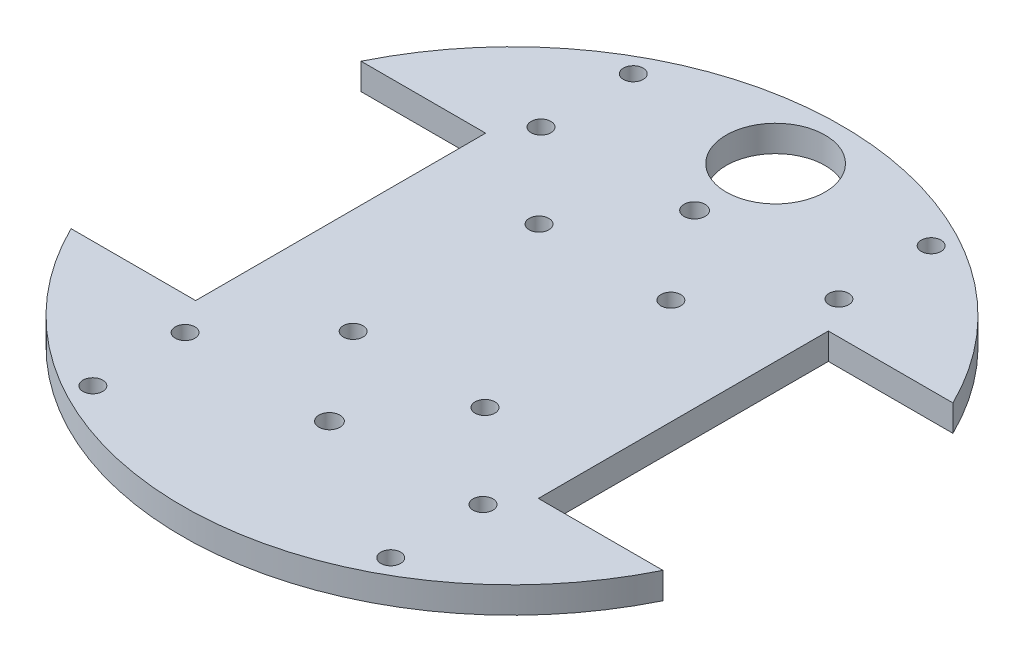
ISO-10303-21;
HEADER;
FILE_DESCRIPTION(('STEP AP214'),'2;1');
FILE_NAME('part.step','',(''),(''),'','','');
FILE_SCHEMA(('AUTOMOTIVE_DESIGN { 1 0 10303 214 1 1 1 1 }'));
ENDSEC;
DATA;
#1=APPLICATION_CONTEXT('core data for automotive mechanical design processes');
#2=APPLICATION_PROTOCOL_DEFINITION('international standard','automotive_design',2000,#1);
#3=PRODUCT_CONTEXT('',#1,'mechanical');
#4=PRODUCT('Part','Part','',(#3));
#5=PRODUCT_RELATED_PRODUCT_CATEGORY('part','',(#4));
#6=PRODUCT_DEFINITION_FORMATION('','',#4);
#7=PRODUCT_DEFINITION_CONTEXT('part definition',#1,'design');
#8=PRODUCT_DEFINITION('design','',#6,#7);
#9=PRODUCT_DEFINITION_SHAPE('','',#8);
#10=(LENGTH_UNIT() NAMED_UNIT(*) SI_UNIT(.MILLI.,.METRE.));
#11=(NAMED_UNIT(*) PLANE_ANGLE_UNIT() SI_UNIT($,.RADIAN.));
#12=(NAMED_UNIT(*) SI_UNIT($,.STERADIAN.) SOLID_ANGLE_UNIT());
#13=UNCERTAINTY_MEASURE_WITH_UNIT(LENGTH_MEASURE(1.E-05),#10,'distance_accuracy_value','');
#14=(GEOMETRIC_REPRESENTATION_CONTEXT(3) GLOBAL_UNCERTAINTY_ASSIGNED_CONTEXT((#13)) GLOBAL_UNIT_ASSIGNED_CONTEXT((#10,
#11,#12)) REPRESENTATION_CONTEXT('',''));
#15=CARTESIAN_POINT('',(0.,0.,0.));
#16=DIRECTION('',(0.,0.,1.));
#17=DIRECTION('',(1.,0.,0.));
#18=AXIS2_PLACEMENT_3D('',#15,#16,#17);
#19=CARTESIAN_POINT('',(0.,4.,-22.));
#20=DIRECTION('',(0.,0.,1.));
#21=DIRECTION('',(1.,0.,0.));
#22=AXIS2_PLACEMENT_3D('',#19,#20,#21);
#23=PLANE('',#22);
#24=DIRECTION('',(-1.,0.,0.));
#25=VECTOR('',#24,1.);
#26=CARTESIAN_POINT('',(0.,0.,-22.));
#27=LINE('',#26,#25);
#28=CARTESIAN_POINT('',(-26.,0.,-22.));
#29=VERTEX_POINT('',#28);
#30=CARTESIAN_POINT('',(-44.8998886412873,0.,-22.));
#31=VERTEX_POINT('',#30);
#32=EDGE_CURVE('E202',#29,#31,#27,.T.);
#33=ORIENTED_EDGE('',*,*,#32,.F.);
#34=DIRECTION('',(0.,-1.,0.));
#35=VECTOR('',#34,1.);
#36=CARTESIAN_POINT('',(-26.,4.,-22.));
#37=LINE('',#36,#35);
#38=CARTESIAN_POINT('',(-26.,4.,-22.));
#39=VERTEX_POINT('',#38);
#40=EDGE_CURVE('E11',#39,#29,#37,.T.);
#41=ORIENTED_EDGE('',*,*,#40,.F.);
#42=DIRECTION('',(-1.,0.,0.));
#43=VECTOR('',#42,1.);
#44=CARTESIAN_POINT('',(0.,4.,-22.));
#45=LINE('',#44,#43);
#46=CARTESIAN_POINT('',(-44.8998886412873,4.,-22.));
#47=VERTEX_POINT('',#46);
#48=EDGE_CURVE('E287',#39,#47,#45,.T.);
#49=ORIENTED_EDGE('',*,*,#48,.T.);
#50=DIRECTION('',(0.,-1.,0.));
#51=VECTOR('',#50,1.);
#52=CARTESIAN_POINT('',(-44.8998886412873,4.,-22.));
#53=LINE('',#52,#51);
#54=EDGE_CURVE('E92',#47,#31,#53,.T.);
#55=ORIENTED_EDGE('',*,*,#54,.T.);
#56=EDGE_LOOP('',(#33,#41,#49,#55));
#57=FACE_BOUND('',#56,.T.);
#58=ADVANCED_FACE('F41',(#57),#23,.T.);
#59=CARTESIAN_POINT('',(-26.,4.,0.));
#60=DIRECTION('',(1.,0.,0.));
#61=DIRECTION('',(0.,0.,-1.));
#62=AXIS2_PLACEMENT_3D('',#59,#60,#61);
#63=PLANE('',#62);
#64=DIRECTION('',(0.,0.,1.));
#65=VECTOR('',#64,1.);
#66=CARTESIAN_POINT('',(-26.,0.,0.));
#67=LINE('',#66,#65);
#68=CARTESIAN_POINT('',(-26.,0.,22.));
#69=VERTEX_POINT('',#68);
#70=EDGE_CURVE('E206',#29,#69,#67,.T.);
#71=ORIENTED_EDGE('',*,*,#70,.T.);
#72=DIRECTION('',(0.,-1.,0.));
#73=VECTOR('',#72,1.);
#74=CARTESIAN_POINT('',(-26.,4.,22.));
#75=LINE('',#74,#73);
#76=CARTESIAN_POINT('',(-26.,4.,22.));
#77=VERTEX_POINT('',#76);
#78=EDGE_CURVE('E50',#77,#69,#75,.T.);
#79=ORIENTED_EDGE('',*,*,#78,.F.);
#80=DIRECTION('',(0.,0.,1.));
#81=VECTOR('',#80,1.);
#82=CARTESIAN_POINT('',(-26.,4.,0.));
#83=LINE('',#82,#81);
#84=EDGE_CURVE('E322',#39,#77,#83,.T.);
#85=ORIENTED_EDGE('',*,*,#84,.F.);
#86=ORIENTED_EDGE('',*,*,#40,.T.);
#87=EDGE_LOOP('',(#71,#79,#85,#86));
#88=FACE_BOUND('',#87,.T.);
#89=ADVANCED_FACE('F328',(#88),#63,.F.);
#90=CARTESIAN_POINT('',(0.,4.,22.));
#91=DIRECTION('',(0.,0.,1.));
#92=DIRECTION('',(1.,0.,0.));
#93=AXIS2_PLACEMENT_3D('',#90,#91,#92);
#94=PLANE('',#93);
#95=DIRECTION('',(-1.,0.,0.));
#96=VECTOR('',#95,1.);
#97=CARTESIAN_POINT('',(0.,0.,22.));
#98=LINE('',#97,#96);
#99=CARTESIAN_POINT('',(-44.8998886412873,0.,22.));
#100=VERTEX_POINT('',#99);
#101=EDGE_CURVE('E209',#69,#100,#98,.T.);
#102=ORIENTED_EDGE('',*,*,#101,.T.);
#103=DIRECTION('',(0.,-1.,0.));
#104=VECTOR('',#103,1.);
#105=CARTESIAN_POINT('',(-44.8998886412873,4.,22.));
#106=LINE('',#105,#104);
#107=CARTESIAN_POINT('',(-44.8998886412873,4.,22.));
#108=VERTEX_POINT('',#107);
#109=EDGE_CURVE('E297',#108,#100,#106,.T.);
#110=ORIENTED_EDGE('',*,*,#109,.F.);
#111=DIRECTION('',(-1.,0.,0.));
#112=VECTOR('',#111,1.);
#113=CARTESIAN_POINT('',(0.,4.,22.));
#114=LINE('',#113,#112);
#115=EDGE_CURVE('E308',#77,#108,#114,.T.);
#116=ORIENTED_EDGE('',*,*,#115,.F.);
#117=ORIENTED_EDGE('',*,*,#78,.T.);
#118=EDGE_LOOP('',(#102,#110,#116,#117));
#119=FACE_BOUND('',#118,.T.);
#120=ADVANCED_FACE('F306',(#119),#94,.F.);
#121=CARTESIAN_POINT('',(0.,4.,0.));
#122=DIRECTION('',(0.,-1.,0.));
#123=DIRECTION('',(0.,0.,-1.));
#124=AXIS2_PLACEMENT_3D('',#121,#122,#123);
#125=CYLINDRICAL_SURFACE('',#124,50.);
#126=CARTESIAN_POINT('',(0.,0.,0.));
#127=DIRECTION('',(0.,1.,0.));
#128=DIRECTION('',(0.,0.,1.));
#129=AXIS2_PLACEMENT_3D('',#126,#127,#128);
#130=CIRCLE('',#129,50.);
#131=CARTESIAN_POINT('',(44.8998886412873,0.,22.));
#132=VERTEX_POINT('',#131);
#133=EDGE_CURVE('E212',#100,#132,#130,.T.);
#134=ORIENTED_EDGE('',*,*,#133,.T.);
#135=DIRECTION('',(0.,-1.,0.));
#136=VECTOR('',#135,1.);
#137=CARTESIAN_POINT('',(44.8998886412873,4.,22.));
#138=LINE('',#137,#136);
#139=CARTESIAN_POINT('',(44.8998886412873,4.,22.));
#140=VERTEX_POINT('',#139);
#141=EDGE_CURVE('E294',#140,#132,#138,.T.);
#142=ORIENTED_EDGE('',*,*,#141,.F.);
#143=CARTESIAN_POINT('',(0.,4.,0.));
#144=DIRECTION('',(0.,1.,0.));
#145=DIRECTION('',(0.,0.,1.));
#146=AXIS2_PLACEMENT_3D('',#143,#144,#145);
#147=CIRCLE('',#146,50.);
#148=EDGE_CURVE('E136',#108,#140,#147,.T.);
#149=ORIENTED_EDGE('',*,*,#148,.F.);
#150=ORIENTED_EDGE('',*,*,#109,.T.);
#151=EDGE_LOOP('',(#134,#142,#149,#150));
#152=FACE_BOUND('',#151,.T.);
#153=ADVANCED_FACE('F318',(#152),#125,.T.);
#154=CARTESIAN_POINT('',(0.,4.,22.));
#155=DIRECTION('',(0.,0.,-1.));
#156=DIRECTION('',(-1.,0.,0.));
#157=AXIS2_PLACEMENT_3D('',#154,#155,#156);
#158=PLANE('',#157);
#159=DIRECTION('',(1.,0.,0.));
#160=VECTOR('',#159,1.);
#161=CARTESIAN_POINT('',(0.,0.,22.));
#162=LINE('',#161,#160);
#163=CARTESIAN_POINT('',(26.,0.,22.));
#164=VERTEX_POINT('',#163);
#165=EDGE_CURVE('E216',#164,#132,#162,.T.);
#166=ORIENTED_EDGE('',*,*,#165,.F.);
#167=DIRECTION('',(0.,-1.,0.));
#168=VECTOR('',#167,1.);
#169=CARTESIAN_POINT('',(26.,4.,22.));
#170=LINE('',#169,#168);
#171=CARTESIAN_POINT('',(26.,4.,22.));
#172=VERTEX_POINT('',#171);
#173=EDGE_CURVE('E121',#172,#164,#170,.T.);
#174=ORIENTED_EDGE('',*,*,#173,.F.);
#175=DIRECTION('',(1.,0.,0.));
#176=VECTOR('',#175,1.);
#177=CARTESIAN_POINT('',(0.,4.,22.));
#178=LINE('',#177,#176);
#179=EDGE_CURVE('E132',#172,#140,#178,.T.);
#180=ORIENTED_EDGE('',*,*,#179,.T.);
#181=ORIENTED_EDGE('',*,*,#141,.T.);
#182=EDGE_LOOP('',(#166,#174,#180,#181));
#183=FACE_BOUND('',#182,.T.);
#184=ADVANCED_FACE('F338',(#183),#158,.T.);
#185=CARTESIAN_POINT('',(26.,4.,0.));
#186=DIRECTION('',(1.,0.,0.));
#187=DIRECTION('',(0.,0.,-1.));
#188=AXIS2_PLACEMENT_3D('',#185,#186,#187);
#189=PLANE('',#188);
#190=DIRECTION('',(0.,0.,1.));
#191=VECTOR('',#190,1.);
#192=CARTESIAN_POINT('',(26.,0.,0.));
#193=LINE('',#192,#191);
#194=CARTESIAN_POINT('',(26.,0.,-22.));
#195=VERTEX_POINT('',#194);
#196=EDGE_CURVE('E119',#195,#164,#193,.T.);
#197=ORIENTED_EDGE('',*,*,#196,.F.);
#198=DIRECTION('',(0.,-1.,0.));
#199=VECTOR('',#198,1.);
#200=CARTESIAN_POINT('',(26.,4.,-22.));
#201=LINE('',#200,#199);
#202=CARTESIAN_POINT('',(26.,4.,-22.));
#203=VERTEX_POINT('',#202);
#204=EDGE_CURVE('E113',#203,#195,#201,.T.);
#205=ORIENTED_EDGE('',*,*,#204,.F.);
#206=DIRECTION('',(0.,0.,1.));
#207=VECTOR('',#206,1.);
#208=CARTESIAN_POINT('',(26.,4.,0.));
#209=LINE('',#208,#207);
#210=EDGE_CURVE('E117',#203,#172,#209,.T.);
#211=ORIENTED_EDGE('',*,*,#210,.T.);
#212=ORIENTED_EDGE('',*,*,#173,.T.);
#213=EDGE_LOOP('',(#197,#205,#211,#212));
#214=FACE_BOUND('',#213,.T.);
#215=ADVANCED_FACE('F115',(#214),#189,.T.);
#216=CARTESIAN_POINT('',(0.,4.,-22.));
#217=DIRECTION('',(0.,0.,-1.));
#218=DIRECTION('',(-1.,0.,0.));
#219=AXIS2_PLACEMENT_3D('',#216,#217,#218);
#220=PLANE('',#219);
#221=DIRECTION('',(1.,0.,0.));
#222=VECTOR('',#221,1.);
#223=CARTESIAN_POINT('',(0.,0.,-22.));
#224=LINE('',#223,#222);
#225=CARTESIAN_POINT('',(44.8998886412873,0.,-22.));
#226=VERTEX_POINT('',#225);
#227=EDGE_CURVE('E85',#195,#226,#224,.T.);
#228=ORIENTED_EDGE('',*,*,#227,.T.);
#229=DIRECTION('',(0.,-1.,0.));
#230=VECTOR('',#229,1.);
#231=CARTESIAN_POINT('',(44.8998886412873,4.,-22.));
#232=LINE('',#231,#230);
#233=CARTESIAN_POINT('',(44.8998886412873,4.,-22.));
#234=VERTEX_POINT('',#233);
#235=EDGE_CURVE('E122',#234,#226,#232,.T.);
#236=ORIENTED_EDGE('',*,*,#235,.F.);
#237=DIRECTION('',(1.,0.,0.));
#238=VECTOR('',#237,1.);
#239=CARTESIAN_POINT('',(0.,4.,-22.));
#240=LINE('',#239,#238);
#241=EDGE_CURVE('E124',#203,#234,#240,.T.);
#242=ORIENTED_EDGE('',*,*,#241,.F.);
#243=ORIENTED_EDGE('',*,*,#204,.T.);
#244=EDGE_LOOP('',(#228,#236,#242,#243));
#245=FACE_BOUND('',#244,.T.);
#246=ADVANCED_FACE('F125',(#245),#220,.F.);
#247=CARTESIAN_POINT('',(-22.6,4.,-27.));
#248=DIRECTION('',(0.,-1.,0.));
#249=DIRECTION('',(0.,0.,-1.));
#250=AXIS2_PLACEMENT_3D('',#247,#248,#249);
#251=CYLINDRICAL_SURFACE('',#250,1.5);
#252=CARTESIAN_POINT('',(-22.6,4.,-27.));
#253=DIRECTION('',(0.,1.,0.));
#254=DIRECTION('',(0.,0.,1.));
#255=AXIS2_PLACEMENT_3D('',#252,#253,#254);
#256=CIRCLE('',#255,1.5);
#257=CARTESIAN_POINT('',(-22.6,4.,-25.5));
#258=VERTEX_POINT('',#257);
#259=EDGE_CURVE('E194',#258,#258,#256,.F.);
#260=ORIENTED_EDGE('',*,*,#259,.F.);
#261=EDGE_LOOP('',(#260));
#262=FACE_BOUND('',#261,.T.);
#263=CARTESIAN_POINT('',(-22.6,0.,-27.));
#264=DIRECTION('',(0.,1.,0.));
#265=DIRECTION('',(0.,0.,1.));
#266=AXIS2_PLACEMENT_3D('',#263,#264,#265);
#267=CIRCLE('',#266,1.5);
#268=CARTESIAN_POINT('',(-22.6,0.,-25.5));
#269=VERTEX_POINT('',#268);
#270=EDGE_CURVE('E279',#269,#269,#267,.F.);
#271=ORIENTED_EDGE('',*,*,#270,.T.);
#272=EDGE_LOOP('',(#271));
#273=FACE_BOUND('',#272,.T.);
#274=ADVANCED_FACE('F346',(#262,#273),#251,.F.);
#275=CARTESIAN_POINT('',(10.,4.,-14.1));
#276=DIRECTION('',(0.,-1.,0.));
#277=DIRECTION('',(0.,0.,-1.));
#278=AXIS2_PLACEMENT_3D('',#275,#276,#277);
#279=CYLINDRICAL_SURFACE('',#278,1.5);
#280=CARTESIAN_POINT('',(10.,4.,-14.1));
#281=DIRECTION('',(0.,1.,0.));
#282=DIRECTION('',(0.,0.,1.));
#283=AXIS2_PLACEMENT_3D('',#280,#281,#282);
#284=CIRCLE('',#283,1.5);
#285=CARTESIAN_POINT('',(10.,4.,-12.6));
#286=VERTEX_POINT('',#285);
#287=EDGE_CURVE('E190',#286,#286,#284,.F.);
#288=ORIENTED_EDGE('',*,*,#287,.F.);
#289=EDGE_LOOP('',(#288));
#290=FACE_BOUND('',#289,.T.);
#291=CARTESIAN_POINT('',(10.,0.,-14.1));
#292=DIRECTION('',(0.,1.,0.));
#293=DIRECTION('',(0.,0.,1.));
#294=AXIS2_PLACEMENT_3D('',#291,#292,#293);
#295=CIRCLE('',#294,1.5);
#296=CARTESIAN_POINT('',(10.,0.,-12.6));
#297=VERTEX_POINT('',#296);
#298=EDGE_CURVE('E275',#297,#297,#295,.F.);
#299=ORIENTED_EDGE('',*,*,#298,.T.);
#300=EDGE_LOOP('',(#299));
#301=FACE_BOUND('',#300,.T.);
#302=ADVANCED_FACE('F399',(#290,#301),#279,.F.);
#303=CARTESIAN_POINT('',(0.,4.,-40.));
#304=DIRECTION('',(0.,-1.,0.));
#305=DIRECTION('',(0.,0.,-1.));
#306=AXIS2_PLACEMENT_3D('',#303,#304,#305);
#307=CYLINDRICAL_SURFACE('',#306,7.5);
#308=CARTESIAN_POINT('',(0.,4.,-40.));
#309=DIRECTION('',(0.,1.,0.));
#310=DIRECTION('',(0.,0.,1.));
#311=AXIS2_PLACEMENT_3D('',#308,#309,#310);
#312=CIRCLE('',#311,7.5);
#313=CARTESIAN_POINT('',(0.,4.,-32.5));
#314=VERTEX_POINT('',#313);
#315=EDGE_CURVE('E186',#314,#314,#312,.T.);
#316=ORIENTED_EDGE('',*,*,#315,.T.);
#317=EDGE_LOOP('',(#316));
#318=FACE_BOUND('',#317,.T.);
#319=CARTESIAN_POINT('',(0.,0.,-40.));
#320=DIRECTION('',(0.,1.,0.));
#321=DIRECTION('',(0.,0.,1.));
#322=AXIS2_PLACEMENT_3D('',#319,#320,#321);
#323=CIRCLE('',#322,7.5);
#324=CARTESIAN_POINT('',(0.,0.,-32.5));
#325=VERTEX_POINT('',#324);
#326=EDGE_CURVE('E271',#325,#325,#323,.T.);
#327=ORIENTED_EDGE('',*,*,#326,.F.);
#328=EDGE_LOOP('',(#327));
#329=FACE_BOUND('',#328,.T.);
#330=ADVANCED_FACE('F395',(#318,#329),#307,.F.);
#331=CARTESIAN_POINT('',(-10.,4.,-14.1));
#332=DIRECTION('',(0.,-1.,0.));
#333=DIRECTION('',(0.,0.,-1.));
#334=AXIS2_PLACEMENT_3D('',#331,#332,#333);
#335=CYLINDRICAL_SURFACE('',#334,1.5);
#336=CARTESIAN_POINT('',(-10.,4.,-14.1));
#337=DIRECTION('',(0.,1.,0.));
#338=DIRECTION('',(0.,0.,1.));
#339=AXIS2_PLACEMENT_3D('',#336,#337,#338);
#340=CIRCLE('',#339,1.5);
#341=CARTESIAN_POINT('',(-10.,4.,-12.6));
#342=VERTEX_POINT('',#341);
#343=EDGE_CURVE('E182',#342,#342,#340,.T.);
#344=ORIENTED_EDGE('',*,*,#343,.T.);
#345=EDGE_LOOP('',(#344));
#346=FACE_BOUND('',#345,.T.);
#347=CARTESIAN_POINT('',(-10.,0.,-14.1));
#348=DIRECTION('',(0.,1.,0.));
#349=DIRECTION('',(0.,0.,1.));
#350=AXIS2_PLACEMENT_3D('',#347,#348,#349);
#351=CIRCLE('',#350,1.5);
#352=CARTESIAN_POINT('',(-10.,0.,-12.6));
#353=VERTEX_POINT('',#352);
#354=EDGE_CURVE('E267',#353,#353,#351,.T.);
#355=ORIENTED_EDGE('',*,*,#354,.F.);
#356=EDGE_LOOP('',(#355));
#357=FACE_BOUND('',#356,.T.);
#358=ADVANCED_FACE('F391',(#346,#357),#335,.F.);
#359=CARTESIAN_POINT('',(-10.,4.,14.1));
#360=DIRECTION('',(0.,-1.,0.));
#361=DIRECTION('',(0.,0.,-1.));
#362=AXIS2_PLACEMENT_3D('',#359,#360,#361);
#363=CYLINDRICAL_SURFACE('',#362,1.5);
#364=CARTESIAN_POINT('',(-10.,4.,14.1));
#365=DIRECTION('',(0.,1.,0.));
#366=DIRECTION('',(0.,0.,1.));
#367=AXIS2_PLACEMENT_3D('',#364,#365,#366);
#368=CIRCLE('',#367,1.5);
#369=CARTESIAN_POINT('',(-10.,4.,15.6));
#370=VERTEX_POINT('',#369);
#371=EDGE_CURVE('E178',#370,#370,#368,.F.);
#372=ORIENTED_EDGE('',*,*,#371,.F.);
#373=EDGE_LOOP('',(#372));
#374=FACE_BOUND('',#373,.T.);
#375=CARTESIAN_POINT('',(-10.,0.,14.1));
#376=DIRECTION('',(0.,1.,0.));
#377=DIRECTION('',(0.,0.,1.));
#378=AXIS2_PLACEMENT_3D('',#375,#376,#377);
#379=CIRCLE('',#378,1.5);
#380=CARTESIAN_POINT('',(-10.,0.,15.6));
#381=VERTEX_POINT('',#380);
#382=EDGE_CURVE('E263',#381,#381,#379,.F.);
#383=ORIENTED_EDGE('',*,*,#382,.T.);
#384=EDGE_LOOP('',(#383));
#385=FACE_BOUND('',#384,.T.);
#386=ADVANCED_FACE('F387',(#374,#385),#363,.F.);
#387=CARTESIAN_POINT('',(10.,4.,14.1));
#388=DIRECTION('',(0.,-1.,0.));
#389=DIRECTION('',(0.,0.,-1.));
#390=AXIS2_PLACEMENT_3D('',#387,#388,#389);
#391=CYLINDRICAL_SURFACE('',#390,1.5);
#392=CARTESIAN_POINT('',(10.,4.,14.1));
#393=DIRECTION('',(0.,1.,0.));
#394=DIRECTION('',(0.,0.,1.));
#395=AXIS2_PLACEMENT_3D('',#392,#393,#394);
#396=CIRCLE('',#395,1.5);
#397=CARTESIAN_POINT('',(10.,4.,15.6));
#398=VERTEX_POINT('',#397);
#399=EDGE_CURVE('E174',#398,#398,#396,.T.);
#400=ORIENTED_EDGE('',*,*,#399,.T.);
#401=EDGE_LOOP('',(#400));
#402=FACE_BOUND('',#401,.T.);
#403=CARTESIAN_POINT('',(10.,0.,14.1));
#404=DIRECTION('',(0.,1.,0.));
#405=DIRECTION('',(0.,0.,1.));
#406=AXIS2_PLACEMENT_3D('',#403,#404,#405);
#407=CIRCLE('',#406,1.5);
#408=CARTESIAN_POINT('',(10.,0.,15.6));
#409=VERTEX_POINT('',#408);
#410=EDGE_CURVE('E259',#409,#409,#407,.T.);
#411=ORIENTED_EDGE('',*,*,#410,.F.);
#412=EDGE_LOOP('',(#411));
#413=FACE_BOUND('',#412,.T.);
#414=ADVANCED_FACE('F383',(#402,#413),#391,.F.);
#415=CARTESIAN_POINT('',(2.22044604925031E-13,4.,27.7));
#416=DIRECTION('',(0.,-1.,0.));
#417=DIRECTION('',(0.,0.,-1.));
#418=AXIS2_PLACEMENT_3D('',#415,#416,#417);
#419=CYLINDRICAL_SURFACE('',#418,1.59999999999999);
#420=CARTESIAN_POINT('',(2.22044604925031E-13,4.,27.7));
#421=DIRECTION('',(0.,1.,0.));
#422=DIRECTION('',(0.,0.,1.));
#423=AXIS2_PLACEMENT_3D('',#420,#421,#422);
#424=CIRCLE('',#423,1.59999999999999);
#425=CARTESIAN_POINT('',(2.22044604925031E-13,4.,29.3));
#426=VERTEX_POINT('',#425);
#427=EDGE_CURVE('E170',#426,#426,#424,.T.);
#428=ORIENTED_EDGE('',*,*,#427,.T.);
#429=EDGE_LOOP('',(#428));
#430=FACE_BOUND('',#429,.T.);
#431=CARTESIAN_POINT('',(2.22044604925031E-13,0.,27.7));
#432=DIRECTION('',(0.,1.,0.));
#433=DIRECTION('',(0.,0.,1.));
#434=AXIS2_PLACEMENT_3D('',#431,#432,#433);
#435=CIRCLE('',#434,1.59999999999999);
#436=CARTESIAN_POINT('',(2.22044604925031E-13,0.,29.3));
#437=VERTEX_POINT('',#436);
#438=EDGE_CURVE('E255',#437,#437,#435,.T.);
#439=ORIENTED_EDGE('',*,*,#438,.F.);
#440=EDGE_LOOP('',(#439));
#441=FACE_BOUND('',#440,.T.);
#442=ADVANCED_FACE('F379',(#430,#441),#419,.F.);
#443=CARTESIAN_POINT('',(2.22044604925031E-13,4.,-27.7));
#444=DIRECTION('',(0.,-1.,0.));
#445=DIRECTION('',(0.,0.,-1.));
#446=AXIS2_PLACEMENT_3D('',#443,#444,#445);
#447=CYLINDRICAL_SURFACE('',#446,1.59999999999999);
#448=CARTESIAN_POINT('',(2.22044604925031E-13,4.,-27.7));
#449=DIRECTION('',(0.,1.,0.));
#450=DIRECTION('',(0.,0.,1.));
#451=AXIS2_PLACEMENT_3D('',#448,#449,#450);
#452=CIRCLE('',#451,1.59999999999999);
#453=CARTESIAN_POINT('',(2.22044604925031E-13,4.,-26.1));
#454=VERTEX_POINT('',#453);
#455=EDGE_CURVE('E166',#454,#454,#452,.T.);
#456=ORIENTED_EDGE('',*,*,#455,.T.);
#457=EDGE_LOOP('',(#456));
#458=FACE_BOUND('',#457,.T.);
#459=CARTESIAN_POINT('',(2.22044604925031E-13,0.,-27.7));
#460=DIRECTION('',(0.,1.,0.));
#461=DIRECTION('',(0.,0.,1.));
#462=AXIS2_PLACEMENT_3D('',#459,#460,#461);
#463=CIRCLE('',#462,1.59999999999999);
#464=CARTESIAN_POINT('',(2.22044604925031E-13,0.,-26.1));
#465=VERTEX_POINT('',#464);
#466=EDGE_CURVE('E251',#465,#465,#463,.T.);
#467=ORIENTED_EDGE('',*,*,#466,.F.);
#468=EDGE_LOOP('',(#467));
#469=FACE_BOUND('',#468,.T.);
#470=ADVANCED_FACE('F375',(#458,#469),#447,.F.);
#471=CARTESIAN_POINT('',(22.6,4.,41.));
#472=DIRECTION('',(0.,-1.,0.));
#473=DIRECTION('',(0.,0.,-1.));
#474=AXIS2_PLACEMENT_3D('',#471,#472,#473);
#475=CYLINDRICAL_SURFACE('',#474,1.49999999999998);
#476=CARTESIAN_POINT('',(22.6,4.,41.));
#477=DIRECTION('',(0.,1.,0.));
#478=DIRECTION('',(0.,0.,1.));
#479=AXIS2_PLACEMENT_3D('',#476,#477,#478);
#480=CIRCLE('',#479,1.49999999999998);
#481=CARTESIAN_POINT('',(22.6,4.,42.5));
#482=VERTEX_POINT('',#481);
#483=EDGE_CURVE('E162',#482,#482,#480,.T.);
#484=ORIENTED_EDGE('',*,*,#483,.T.);
#485=EDGE_LOOP('',(#484));
#486=FACE_BOUND('',#485,.T.);
#487=CARTESIAN_POINT('',(22.6,0.,41.));
#488=DIRECTION('',(0.,1.,0.));
#489=DIRECTION('',(0.,0.,1.));
#490=AXIS2_PLACEMENT_3D('',#487,#488,#489);
#491=CIRCLE('',#490,1.49999999999998);
#492=CARTESIAN_POINT('',(22.6,0.,42.5));
#493=VERTEX_POINT('',#492);
#494=EDGE_CURVE('E247',#493,#493,#491,.T.);
#495=ORIENTED_EDGE('',*,*,#494,.F.);
#496=EDGE_LOOP('',(#495));
#497=FACE_BOUND('',#496,.T.);
#498=ADVANCED_FACE('F371',(#486,#497),#475,.F.);
#499=CARTESIAN_POINT('',(-22.6,4.,-41.));
#500=DIRECTION('',(0.,-1.,0.));
#501=DIRECTION('',(0.,0.,-1.));
#502=AXIS2_PLACEMENT_3D('',#499,#500,#501);
#503=CYLINDRICAL_SURFACE('',#502,1.5);
#504=CARTESIAN_POINT('',(-22.6,4.,-41.));
#505=DIRECTION('',(0.,1.,0.));
#506=DIRECTION('',(0.,0.,1.));
#507=AXIS2_PLACEMENT_3D('',#504,#505,#506);
#508=CIRCLE('',#507,1.5);
#509=CARTESIAN_POINT('',(-22.6,4.,-39.5));
#510=VERTEX_POINT('',#509);
#511=EDGE_CURVE('E158',#510,#510,#508,.F.);
#512=ORIENTED_EDGE('',*,*,#511,.F.);
#513=EDGE_LOOP('',(#512));
#514=FACE_BOUND('',#513,.T.);
#515=CARTESIAN_POINT('',(-22.6,0.,-41.));
#516=DIRECTION('',(0.,1.,0.));
#517=DIRECTION('',(0.,0.,1.));
#518=AXIS2_PLACEMENT_3D('',#515,#516,#517);
#519=CIRCLE('',#518,1.5);
#520=CARTESIAN_POINT('',(-22.6,0.,-39.5));
#521=VERTEX_POINT('',#520);
#522=EDGE_CURVE('E243',#521,#521,#519,.F.);
#523=ORIENTED_EDGE('',*,*,#522,.T.);
#524=EDGE_LOOP('',(#523));
#525=FACE_BOUND('',#524,.T.);
#526=ADVANCED_FACE('F367',(#514,#525),#503,.F.);
#527=CARTESIAN_POINT('',(22.6,4.,-41.));
#528=DIRECTION('',(0.,-1.,0.));
#529=DIRECTION('',(0.,0.,-1.));
#530=AXIS2_PLACEMENT_3D('',#527,#528,#529);
#531=CYLINDRICAL_SURFACE('',#530,1.49999999999998);
#532=CARTESIAN_POINT('',(22.6,4.,-41.));
#533=DIRECTION('',(0.,1.,0.));
#534=DIRECTION('',(0.,0.,1.));
#535=AXIS2_PLACEMENT_3D('',#532,#533,#534);
#536=CIRCLE('',#535,1.49999999999998);
#537=CARTESIAN_POINT('',(22.6,4.,-39.5000000000001));
#538=VERTEX_POINT('',#537);
#539=EDGE_CURVE('E154',#538,#538,#536,.F.);
#540=ORIENTED_EDGE('',*,*,#539,.F.);
#541=EDGE_LOOP('',(#540));
#542=FACE_BOUND('',#541,.T.);
#543=CARTESIAN_POINT('',(22.6,0.,-41.));
#544=DIRECTION('',(0.,1.,0.));
#545=DIRECTION('',(0.,0.,1.));
#546=AXIS2_PLACEMENT_3D('',#543,#544,#545);
#547=CIRCLE('',#546,1.49999999999998);
#548=CARTESIAN_POINT('',(22.6,0.,-39.5000000000001));
#549=VERTEX_POINT('',#548);
#550=EDGE_CURVE('E239',#549,#549,#547,.F.);
#551=ORIENTED_EDGE('',*,*,#550,.T.);
#552=EDGE_LOOP('',(#551));
#553=FACE_BOUND('',#552,.T.);
#554=ADVANCED_FACE('F363',(#542,#553),#531,.F.);
#555=CARTESIAN_POINT('',(-22.6,4.,41.));
#556=DIRECTION('',(0.,-1.,0.));
#557=DIRECTION('',(0.,0.,-1.));
#558=AXIS2_PLACEMENT_3D('',#555,#556,#557);
#559=CYLINDRICAL_SURFACE('',#558,1.5);
#560=CARTESIAN_POINT('',(-22.6,4.,41.));
#561=DIRECTION('',(0.,1.,0.));
#562=DIRECTION('',(0.,0.,1.));
#563=AXIS2_PLACEMENT_3D('',#560,#561,#562);
#564=CIRCLE('',#563,1.5);
#565=CARTESIAN_POINT('',(-22.6,4.,42.5));
#566=VERTEX_POINT('',#565);
#567=EDGE_CURVE('E150',#566,#566,#564,.T.);
#568=ORIENTED_EDGE('',*,*,#567,.T.);
#569=EDGE_LOOP('',(#568));
#570=FACE_BOUND('',#569,.T.);
#571=CARTESIAN_POINT('',(-22.6,0.,41.));
#572=DIRECTION('',(0.,1.,0.));
#573=DIRECTION('',(0.,0.,1.));
#574=AXIS2_PLACEMENT_3D('',#571,#572,#573);
#575=CIRCLE('',#574,1.5);
#576=CARTESIAN_POINT('',(-22.6,0.,42.5));
#577=VERTEX_POINT('',#576);
#578=EDGE_CURVE('E235',#577,#577,#575,.T.);
#579=ORIENTED_EDGE('',*,*,#578,.F.);
#580=EDGE_LOOP('',(#579));
#581=FACE_BOUND('',#580,.T.);
#582=ADVANCED_FACE('F359',(#570,#581),#559,.F.);
#583=CARTESIAN_POINT('',(-22.6,4.,27.));
#584=DIRECTION('',(0.,-1.,0.));
#585=DIRECTION('',(0.,0.,-1.));
#586=AXIS2_PLACEMENT_3D('',#583,#584,#585);
#587=CYLINDRICAL_SURFACE('',#586,1.5);
#588=CARTESIAN_POINT('',(-22.6,4.,27.));
#589=DIRECTION('',(0.,1.,0.));
#590=DIRECTION('',(0.,0.,1.));
#591=AXIS2_PLACEMENT_3D('',#588,#589,#590);
#592=CIRCLE('',#591,1.5);
#593=CARTESIAN_POINT('',(-22.6,4.,28.5));
#594=VERTEX_POINT('',#593);
#595=EDGE_CURVE('E146',#594,#594,#592,.T.);
#596=ORIENTED_EDGE('',*,*,#595,.T.);
#597=EDGE_LOOP('',(#596));
#598=FACE_BOUND('',#597,.T.);
#599=CARTESIAN_POINT('',(-22.6,0.,27.));
#600=DIRECTION('',(0.,1.,0.));
#601=DIRECTION('',(0.,0.,1.));
#602=AXIS2_PLACEMENT_3D('',#599,#600,#601);
#603=CIRCLE('',#602,1.5);
#604=CARTESIAN_POINT('',(-22.6,0.,28.5));
#605=VERTEX_POINT('',#604);
#606=EDGE_CURVE('E231',#605,#605,#603,.T.);
#607=ORIENTED_EDGE('',*,*,#606,.F.);
#608=EDGE_LOOP('',(#607));
#609=FACE_BOUND('',#608,.T.);
#610=ADVANCED_FACE('F355',(#598,#609),#587,.F.);
#611=CARTESIAN_POINT('',(22.6,4.,27.));
#612=DIRECTION('',(0.,-1.,0.));
#613=DIRECTION('',(0.,0.,-1.));
#614=AXIS2_PLACEMENT_3D('',#611,#612,#613);
#615=CYLINDRICAL_SURFACE('',#614,1.49999999999999);
#616=CARTESIAN_POINT('',(22.6,4.,27.));
#617=DIRECTION('',(0.,1.,0.));
#618=DIRECTION('',(0.,0.,1.));
#619=AXIS2_PLACEMENT_3D('',#616,#617,#618);
#620=CIRCLE('',#619,1.49999999999999);
#621=CARTESIAN_POINT('',(22.6,4.,28.5));
#622=VERTEX_POINT('',#621);
#623=EDGE_CURVE('E142',#622,#622,#620,.T.);
#624=ORIENTED_EDGE('',*,*,#623,.T.);
#625=EDGE_LOOP('',(#624));
#626=FACE_BOUND('',#625,.T.);
#627=CARTESIAN_POINT('',(22.6,0.,27.));
#628=DIRECTION('',(0.,1.,0.));
#629=DIRECTION('',(0.,0.,1.));
#630=AXIS2_PLACEMENT_3D('',#627,#628,#629);
#631=CIRCLE('',#630,1.49999999999999);
#632=CARTESIAN_POINT('',(22.6,0.,28.5));
#633=VERTEX_POINT('',#632);
#634=EDGE_CURVE('E227',#633,#633,#631,.T.);
#635=ORIENTED_EDGE('',*,*,#634,.F.);
#636=EDGE_LOOP('',(#635));
#637=FACE_BOUND('',#636,.T.);
#638=ADVANCED_FACE('F351',(#626,#637),#615,.F.);
#639=CARTESIAN_POINT('',(0.,4.,0.));
#640=DIRECTION('',(0.,-1.,0.));
#641=DIRECTION('',(0.,0.,-1.));
#642=AXIS2_PLACEMENT_3D('',#639,#640,#641);
#643=CYLINDRICAL_SURFACE('',#642,50.);
#644=CARTESIAN_POINT('',(0.,0.,0.));
#645=DIRECTION('',(0.,1.,0.));
#646=DIRECTION('',(0.,0.,1.));
#647=AXIS2_PLACEMENT_3D('',#644,#645,#646);
#648=CIRCLE('',#647,50.);
#649=EDGE_CURVE('E224',#226,#31,#648,.T.);
#650=ORIENTED_EDGE('',*,*,#649,.T.);
#651=ORIENTED_EDGE('',*,*,#54,.F.);
#652=CARTESIAN_POINT('',(0.,4.,0.));
#653=DIRECTION('',(0.,1.,0.));
#654=DIRECTION('',(0.,0.,1.));
#655=AXIS2_PLACEMENT_3D('',#652,#653,#654);
#656=CIRCLE('',#655,50.);
#657=EDGE_CURVE('E58',#234,#47,#656,.T.);
#658=ORIENTED_EDGE('',*,*,#657,.F.);
#659=ORIENTED_EDGE('',*,*,#235,.T.);
#660=EDGE_LOOP('',(#650,#651,#658,#659));
#661=FACE_BOUND('',#660,.T.);
#662=ADVANCED_FACE('F347',(#661),#643,.T.);
#663=CARTESIAN_POINT('',(22.6,4.,-27.));
#664=DIRECTION('',(0.,-1.,0.));
#665=DIRECTION('',(0.,0.,-1.));
#666=AXIS2_PLACEMENT_3D('',#663,#664,#665);
#667=CYLINDRICAL_SURFACE('',#666,1.49999999999998);
#668=CARTESIAN_POINT('',(22.6,4.,-27.));
#669=DIRECTION('',(0.,1.,0.));
#670=DIRECTION('',(0.,0.,1.));
#671=AXIS2_PLACEMENT_3D('',#668,#669,#670);
#672=CIRCLE('',#671,1.49999999999998);
#673=CARTESIAN_POINT('',(22.6,4.,-25.5000000000001));
#674=VERTEX_POINT('',#673);
#675=EDGE_CURVE('E198',#674,#674,#672,.F.);
#676=ORIENTED_EDGE('',*,*,#675,.F.);
#677=EDGE_LOOP('',(#676));
#678=FACE_BOUND('',#677,.T.);
#679=CARTESIAN_POINT('',(22.6,0.,-27.));
#680=DIRECTION('',(0.,1.,0.));
#681=DIRECTION('',(0.,0.,1.));
#682=AXIS2_PLACEMENT_3D('',#679,#680,#681);
#683=CIRCLE('',#682,1.49999999999998);
#684=CARTESIAN_POINT('',(22.6,0.,-25.5000000000001));
#685=VERTEX_POINT('',#684);
#686=EDGE_CURVE('E283',#685,#685,#683,.F.);
#687=ORIENTED_EDGE('',*,*,#686,.T.);
#688=EDGE_LOOP('',(#687));
#689=FACE_BOUND('',#688,.T.);
#690=ADVANCED_FACE('F350',(#678,#689),#667,.F.);
#691=CARTESIAN_POINT('',(0.,4.,0.));
#692=DIRECTION('',(0.,1.,0.));
#693=DIRECTION('',(0.,0.,1.));
#694=AXIS2_PLACEMENT_3D('',#691,#692,#693);
#695=PLANE('',#694);
#696=ORIENTED_EDGE('',*,*,#48,.F.);
#697=ORIENTED_EDGE('',*,*,#84,.T.);
#698=ORIENTED_EDGE('',*,*,#115,.T.);
#699=ORIENTED_EDGE('',*,*,#148,.T.);
#700=ORIENTED_EDGE('',*,*,#179,.F.);
#701=ORIENTED_EDGE('',*,*,#210,.F.);
#702=ORIENTED_EDGE('',*,*,#241,.T.);
#703=ORIENTED_EDGE('',*,*,#657,.T.);
#704=EDGE_LOOP('',(#696,#697,#698,#699,#700,#701,#702,#703));
#705=FACE_BOUND('',#704,.T.);
#706=ORIENTED_EDGE('',*,*,#623,.F.);
#707=EDGE_LOOP('',(#706));
#708=FACE_BOUND('',#707,.T.);
#709=ORIENTED_EDGE('',*,*,#595,.F.);
#710=EDGE_LOOP('',(#709));
#711=FACE_BOUND('',#710,.T.);
#712=ORIENTED_EDGE('',*,*,#567,.F.);
#713=EDGE_LOOP('',(#712));
#714=FACE_BOUND('',#713,.T.);
#715=ORIENTED_EDGE('',*,*,#539,.T.);
#716=EDGE_LOOP('',(#715));
#717=FACE_BOUND('',#716,.T.);
#718=ORIENTED_EDGE('',*,*,#511,.T.);
#719=EDGE_LOOP('',(#718));
#720=FACE_BOUND('',#719,.T.);
#721=ORIENTED_EDGE('',*,*,#483,.F.);
#722=EDGE_LOOP('',(#721));
#723=FACE_BOUND('',#722,.T.);
#724=ORIENTED_EDGE('',*,*,#455,.F.);
#725=EDGE_LOOP('',(#724));
#726=FACE_BOUND('',#725,.T.);
#727=ORIENTED_EDGE('',*,*,#427,.F.);
#728=EDGE_LOOP('',(#727));
#729=FACE_BOUND('',#728,.T.);
#730=ORIENTED_EDGE('',*,*,#399,.F.);
#731=EDGE_LOOP('',(#730));
#732=FACE_BOUND('',#731,.T.);
#733=ORIENTED_EDGE('',*,*,#371,.T.);
#734=EDGE_LOOP('',(#733));
#735=FACE_BOUND('',#734,.T.);
#736=ORIENTED_EDGE('',*,*,#343,.F.);
#737=EDGE_LOOP('',(#736));
#738=FACE_BOUND('',#737,.T.);
#739=ORIENTED_EDGE('',*,*,#315,.F.);
#740=EDGE_LOOP('',(#739));
#741=FACE_BOUND('',#740,.T.);
#742=ORIENTED_EDGE('',*,*,#287,.T.);
#743=EDGE_LOOP('',(#742));
#744=FACE_BOUND('',#743,.T.);
#745=ORIENTED_EDGE('',*,*,#259,.T.);
#746=EDGE_LOOP('',(#745));
#747=FACE_BOUND('',#746,.T.);
#748=ORIENTED_EDGE('',*,*,#675,.T.);
#749=EDGE_LOOP('',(#748));
#750=FACE_BOUND('',#749,.T.);
#751=ADVANCED_FACE('F129',(#705,#708,#711,#714,#717,#720,#723,#726,#729,#732,#735,#738,#741,
#744,#747,#750),#695,.T.);
#752=CARTESIAN_POINT('',(0.,0.,0.));
#753=DIRECTION('',(0.,1.,0.));
#754=DIRECTION('',(0.,0.,1.));
#755=AXIS2_PLACEMENT_3D('',#752,#753,#754);
#756=PLANE('',#755);
#757=ORIENTED_EDGE('',*,*,#32,.T.);
#758=ORIENTED_EDGE('',*,*,#649,.F.);
#759=ORIENTED_EDGE('',*,*,#227,.F.);
#760=ORIENTED_EDGE('',*,*,#196,.T.);
#761=ORIENTED_EDGE('',*,*,#165,.T.);
#762=ORIENTED_EDGE('',*,*,#133,.F.);
#763=ORIENTED_EDGE('',*,*,#101,.F.);
#764=ORIENTED_EDGE('',*,*,#70,.F.);
#765=EDGE_LOOP('',(#757,#758,#759,#760,#761,#762,#763,#764));
#766=FACE_BOUND('',#765,.T.);
#767=ORIENTED_EDGE('',*,*,#634,.T.);
#768=EDGE_LOOP('',(#767));
#769=FACE_BOUND('',#768,.T.);
#770=ORIENTED_EDGE('',*,*,#606,.T.);
#771=EDGE_LOOP('',(#770));
#772=FACE_BOUND('',#771,.T.);
#773=ORIENTED_EDGE('',*,*,#578,.T.);
#774=EDGE_LOOP('',(#773));
#775=FACE_BOUND('',#774,.T.);
#776=ORIENTED_EDGE('',*,*,#550,.F.);
#777=EDGE_LOOP('',(#776));
#778=FACE_BOUND('',#777,.T.);
#779=ORIENTED_EDGE('',*,*,#522,.F.);
#780=EDGE_LOOP('',(#779));
#781=FACE_BOUND('',#780,.T.);
#782=ORIENTED_EDGE('',*,*,#494,.T.);
#783=EDGE_LOOP('',(#782));
#784=FACE_BOUND('',#783,.T.);
#785=ORIENTED_EDGE('',*,*,#466,.T.);
#786=EDGE_LOOP('',(#785));
#787=FACE_BOUND('',#786,.T.);
#788=ORIENTED_EDGE('',*,*,#438,.T.);
#789=EDGE_LOOP('',(#788));
#790=FACE_BOUND('',#789,.T.);
#791=ORIENTED_EDGE('',*,*,#410,.T.);
#792=EDGE_LOOP('',(#791));
#793=FACE_BOUND('',#792,.T.);
#794=ORIENTED_EDGE('',*,*,#382,.F.);
#795=EDGE_LOOP('',(#794));
#796=FACE_BOUND('',#795,.T.);
#797=ORIENTED_EDGE('',*,*,#354,.T.);
#798=EDGE_LOOP('',(#797));
#799=FACE_BOUND('',#798,.T.);
#800=ORIENTED_EDGE('',*,*,#326,.T.);
#801=EDGE_LOOP('',(#800));
#802=FACE_BOUND('',#801,.T.);
#803=ORIENTED_EDGE('',*,*,#298,.F.);
#804=EDGE_LOOP('',(#803));
#805=FACE_BOUND('',#804,.T.);
#806=ORIENTED_EDGE('',*,*,#270,.F.);
#807=EDGE_LOOP('',(#806));
#808=FACE_BOUND('',#807,.T.);
#809=ORIENTED_EDGE('',*,*,#686,.F.);
#810=EDGE_LOOP('',(#809));
#811=FACE_BOUND('',#810,.T.);
#812=ADVANCED_FACE('F313',(#766,#769,#772,#775,#778,#781,#784,#787,#790,#793,#796,#799,#802,
#805,#808,#811),#756,.F.);
#813=CLOSED_SHELL('',(#58,#89,#120,#153,#184,#215,#246,#274,#302,#330,#358,#386,#414,#442,#470,
#498,#526,#554,#582,#610,#638,#662,#690,#751,#812));
#814=MANIFOLD_SOLID_BREP('B2',#813);
#815=ADVANCED_BREP_SHAPE_REPRESENTATION('',(#18,#814),#14);
#816=SHAPE_DEFINITION_REPRESENTATION(#9,#815);
ENDSEC;
END-ISO-10303-21;
